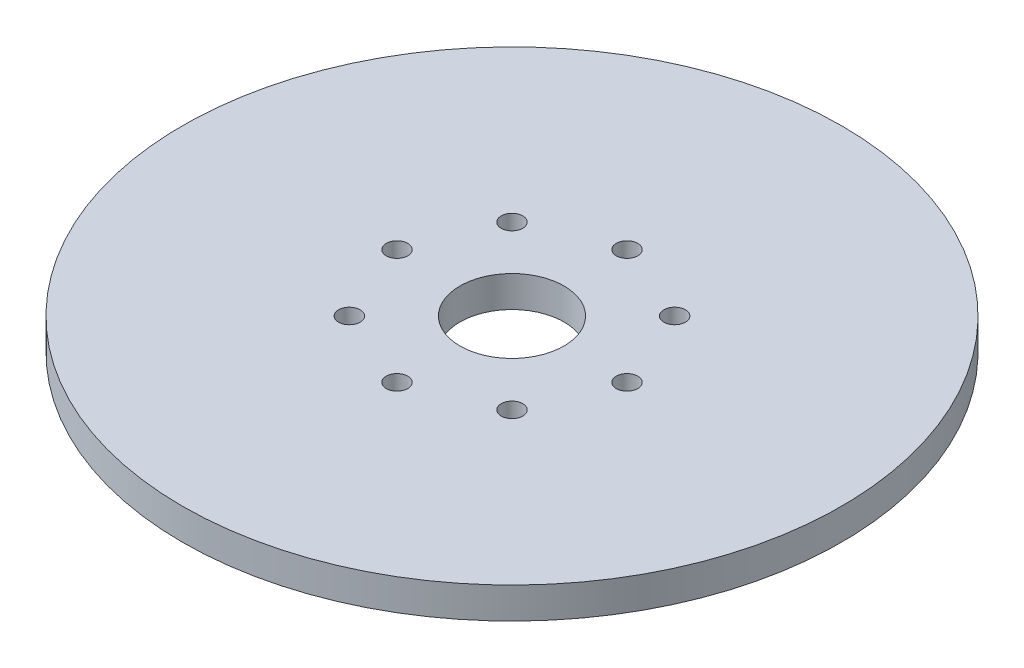
ISO-10303-21;
HEADER;
FILE_DESCRIPTION(('STEP AP214'),'2;1');
FILE_NAME('part.step','',(''),(''),'','','');
FILE_SCHEMA(('AUTOMOTIVE_DESIGN { 1 0 10303 214 1 1 1 1 }'));
ENDSEC;
DATA;
#1=APPLICATION_CONTEXT('core data for automotive mechanical design processes');
#2=APPLICATION_PROTOCOL_DEFINITION('international standard','automotive_design',2000,#1);
#3=PRODUCT_CONTEXT('',#1,'mechanical');
#4=PRODUCT('Part','Part','',(#3));
#5=PRODUCT_RELATED_PRODUCT_CATEGORY('part','',(#4));
#6=PRODUCT_DEFINITION_FORMATION('','',#4);
#7=PRODUCT_DEFINITION_CONTEXT('part definition',#1,'design');
#8=PRODUCT_DEFINITION('design','',#6,#7);
#9=PRODUCT_DEFINITION_SHAPE('','',#8);
#10=(LENGTH_UNIT() NAMED_UNIT(*) SI_UNIT(.MILLI.,.METRE.));
#11=(NAMED_UNIT(*) PLANE_ANGLE_UNIT() SI_UNIT($,.RADIAN.));
#12=(NAMED_UNIT(*) SI_UNIT($,.STERADIAN.) SOLID_ANGLE_UNIT());
#13=UNCERTAINTY_MEASURE_WITH_UNIT(LENGTH_MEASURE(1.E-05),#10,'distance_accuracy_value','');
#14=(GEOMETRIC_REPRESENTATION_CONTEXT(3) GLOBAL_UNCERTAINTY_ASSIGNED_CONTEXT((#13)) GLOBAL_UNIT_ASSIGNED_CONTEXT((#10,
#11,#12)) REPRESENTATION_CONTEXT('',''));
#15=CARTESIAN_POINT('',(0.,0.,0.));
#16=DIRECTION('',(0.,0.,1.));
#17=DIRECTION('',(1.,0.,0.));
#18=AXIS2_PLACEMENT_3D('',#15,#16,#17);
#19=CARTESIAN_POINT('',(0.,9.,0.));
#20=DIRECTION('',(0.,-1.,0.));
#21=DIRECTION('',(0.,0.,-1.));
#22=AXIS2_PLACEMENT_3D('',#19,#20,#21);
#23=CYLINDRICAL_SURFACE('',#22,95.);
#24=CARTESIAN_POINT('',(0.,9.,0.));
#25=DIRECTION('',(0.,1.,0.));
#26=DIRECTION('',(0.,0.,1.));
#27=AXIS2_PLACEMENT_3D('',#24,#25,#26);
#28=CIRCLE('',#27,95.);
#29=CARTESIAN_POINT('',(0.,9.,95.));
#30=VERTEX_POINT('',#29);
#31=EDGE_CURVE('E10',#30,#30,#28,.T.);
#32=ORIENTED_EDGE('',*,*,#31,.F.);
#33=EDGE_LOOP('',(#32));
#34=FACE_BOUND('',#33,.T.);
#35=CARTESIAN_POINT('',(0.,0.,0.));
#36=DIRECTION('',(0.,1.,0.));
#37=DIRECTION('',(0.,0.,1.));
#38=AXIS2_PLACEMENT_3D('',#35,#36,#37);
#39=CIRCLE('',#38,95.);
#40=CARTESIAN_POINT('',(0.,0.,95.));
#41=VERTEX_POINT('',#40);
#42=EDGE_CURVE('E37',#41,#41,#39,.T.);
#43=ORIENTED_EDGE('',*,*,#42,.T.);
#44=EDGE_LOOP('',(#43));
#45=FACE_BOUND('',#44,.T.);
#46=ADVANCED_FACE('F40',(#34,#45),#23,.T.);
#47=CARTESIAN_POINT('',(0.,9.,0.));
#48=DIRECTION('',(0.,1.,0.));
#49=DIRECTION('',(0.,0.,1.));
#50=AXIS2_PLACEMENT_3D('',#47,#48,#49);
#51=PLANE('',#50);
#52=CARTESIAN_POINT('',(1.15748573360503E-13,9.,33.151709010381));
#53=DIRECTION('',(0.,1.,0.));
#54=DIRECTION('',(1.,0.,0.));
#55=AXIS2_PLACEMENT_3D('',#52,#53,#54);
#56=CIRCLE('',#55,3.10765287868737);
#57=CARTESIAN_POINT('',(3.10765287868749,9.,33.151709010381));
#58=VERTEX_POINT('',#57);
#59=EDGE_CURVE('E88',#58,#58,#56,.T.);
#60=ORIENTED_EDGE('',*,*,#59,.F.);
#61=EDGE_LOOP('',(#60));
#62=FACE_BOUND('',#61,.T.);
#63=CARTESIAN_POINT('',(23.4417982491637,9.,23.4417982491634));
#64=DIRECTION('',(0.,1.,0.));
#65=DIRECTION('',(0.707106781186544,0.,-0.707106781186551));
#66=AXIS2_PLACEMENT_3D('',#63,#64,#65);
#67=CIRCLE('',#66,3.10765287868737);
#68=CARTESIAN_POINT('',(25.6392406732574,9.,21.2443558250697));
#69=VERTEX_POINT('',#68);
#70=EDGE_CURVE('E79',#69,#69,#67,.T.);
#71=ORIENTED_EDGE('',*,*,#70,.F.);
#72=EDGE_LOOP('',(#71));
#73=FACE_BOUND('',#72,.T.);
#74=CARTESIAN_POINT('',(33.151709010381,9.,0.));
#75=DIRECTION('',(0.,1.,0.));
#76=DIRECTION('',(0.,0.,-1.));
#77=AXIS2_PLACEMENT_3D('',#74,#75,#76);
#78=CIRCLE('',#77,3.10765287868737);
#79=CARTESIAN_POINT('',(33.151709010381,9.,-3.10765287868737));
#80=VERTEX_POINT('',#79);
#81=EDGE_CURVE('E74',#80,#80,#78,.T.);
#82=ORIENTED_EDGE('',*,*,#81,.F.);
#83=EDGE_LOOP('',(#82));
#84=FACE_BOUND('',#83,.T.);
#85=CARTESIAN_POINT('',(23.4417982491634,9.,-23.4417982491638));
#86=DIRECTION('',(0.,1.,0.));
#87=DIRECTION('',(-0.707106781186554,0.,-0.707106781186541));
#88=AXIS2_PLACEMENT_3D('',#85,#86,#87);
#89=CIRCLE('',#88,3.10765287868737);
#90=CARTESIAN_POINT('',(21.2443558250696,9.,-25.6392406732575));
#91=VERTEX_POINT('',#90);
#92=EDGE_CURVE('E70',#91,#91,#89,.T.);
#93=ORIENTED_EDGE('',*,*,#92,.F.);
#94=EDGE_LOOP('',(#93));
#95=FACE_BOUND('',#94,.T.);
#96=CARTESIAN_POINT('',(-3.47245720081509E-13,9.,-33.151709010381));
#97=DIRECTION('',(0.,1.,0.));
#98=DIRECTION('',(-1.,0.,0.));
#99=AXIS2_PLACEMENT_3D('',#96,#97,#98);
#100=CIRCLE('',#99,3.10765287868737);
#101=CARTESIAN_POINT('',(-3.10765287868772,9.,-33.1517090103809));
#102=VERTEX_POINT('',#101);
#103=EDGE_CURVE('E100',#102,#102,#100,.T.);
#104=ORIENTED_EDGE('',*,*,#103,.F.);
#105=EDGE_LOOP('',(#104));
#106=FACE_BOUND('',#105,.T.);
#107=CARTESIAN_POINT('',(-23.4417982491638,9.,-23.4417982491633));
#108=DIRECTION('',(0.,1.,0.));
#109=DIRECTION('',(-0.707106781186539,0.,0.707106781186556));
#110=AXIS2_PLACEMENT_3D('',#107,#108,#109);
#111=CIRCLE('',#110,3.10765287868737);
#112=CARTESIAN_POINT('',(-25.6392406732576,9.,-21.2443558250695));
#113=VERTEX_POINT('',#112);
#114=EDGE_CURVE('E93',#113,#113,#111,.T.);
#115=ORIENTED_EDGE('',*,*,#114,.F.);
#116=EDGE_LOOP('',(#115));
#117=FACE_BOUND('',#116,.T.);
#118=CARTESIAN_POINT('',(-23.4417982491635,9.,23.4417982491636));
#119=DIRECTION('',(0.,1.,0.));
#120=DIRECTION('',(0.707106781186549,0.,0.707106781186546));
#121=AXIS2_PLACEMENT_3D('',#118,#119,#120);
#122=CIRCLE('',#121,3.10765287868737);
#123=CARTESIAN_POINT('',(-21.2443558250698,9.,25.6392406732573));
#124=VERTEX_POINT('',#123);
#125=EDGE_CURVE('E61',#124,#124,#122,.T.);
#126=ORIENTED_EDGE('',*,*,#125,.F.);
#127=EDGE_LOOP('',(#126));
#128=FACE_BOUND('',#127,.T.);
#129=CARTESIAN_POINT('',(-33.151709010381,9.,0.));
#130=DIRECTION('',(0.,1.,0.));
#131=DIRECTION('',(0.,0.,1.));
#132=AXIS2_PLACEMENT_3D('',#129,#130,#131);
#133=CIRCLE('',#132,3.10765287868737);
#134=CARTESIAN_POINT('',(-33.151709010381,9.,3.10765287868737));
#135=VERTEX_POINT('',#134);
#136=EDGE_CURVE('E54',#135,#135,#133,.T.);
#137=ORIENTED_EDGE('',*,*,#136,.F.);
#138=EDGE_LOOP('',(#137));
#139=FACE_BOUND('',#138,.T.);
#140=CARTESIAN_POINT('',(0.,9.,0.));
#141=DIRECTION('',(0.,1.,0.));
#142=DIRECTION('',(0.,0.,1.));
#143=AXIS2_PLACEMENT_3D('',#140,#141,#142);
#144=CIRCLE('',#143,15.);
#145=CARTESIAN_POINT('',(0.,9.,15.));
#146=VERTEX_POINT('',#145);
#147=EDGE_CURVE('E50',#146,#146,#144,.T.);
#148=ORIENTED_EDGE('',*,*,#147,.F.);
#149=EDGE_LOOP('',(#148));
#150=FACE_BOUND('',#149,.T.);
#151=ORIENTED_EDGE('',*,*,#31,.T.);
#152=EDGE_LOOP('',(#151));
#153=FACE_BOUND('',#152,.T.);
#154=ADVANCED_FACE('F115',(#62,#73,#84,#95,#106,#117,#128,#139,#150,#153),#51,.T.);
#155=CARTESIAN_POINT('',(0.,0.,0.));
#156=DIRECTION('',(0.,1.,0.));
#157=DIRECTION('',(0.,0.,1.));
#158=AXIS2_PLACEMENT_3D('',#155,#156,#157);
#159=PLANE('',#158);
#160=CARTESIAN_POINT('',(0.,0.,0.));
#161=DIRECTION('',(0.,1.,0.));
#162=DIRECTION('',(0.,0.,1.));
#163=AXIS2_PLACEMENT_3D('',#160,#161,#162);
#164=CIRCLE('',#163,15.);
#165=CARTESIAN_POINT('',(0.,0.,15.));
#166=VERTEX_POINT('',#165);
#167=EDGE_CURVE('E47',#166,#166,#164,.T.);
#168=ORIENTED_EDGE('',*,*,#167,.T.);
#169=EDGE_LOOP('',(#168));
#170=FACE_BOUND('',#169,.T.);
#171=ORIENTED_EDGE('',*,*,#42,.F.);
#172=EDGE_LOOP('',(#171));
#173=FACE_BOUND('',#172,.T.);
#174=ADVANCED_FACE('F113',(#170,#173),#159,.F.);
#175=CARTESIAN_POINT('',(0.,9.,0.));
#176=DIRECTION('',(0.,-1.,0.));
#177=DIRECTION('',(0.,0.,-1.));
#178=AXIS2_PLACEMENT_3D('',#175,#176,#177);
#179=CYLINDRICAL_SURFACE('',#178,15.);
#180=ORIENTED_EDGE('',*,*,#147,.T.);
#181=EDGE_LOOP('',(#180));
#182=FACE_BOUND('',#181,.T.);
#183=ORIENTED_EDGE('',*,*,#167,.F.);
#184=EDGE_LOOP('',(#183));
#185=FACE_BOUND('',#184,.T.);
#186=ADVANCED_FACE('F127',(#182,#185),#179,.F.);
#187=CARTESIAN_POINT('',(-33.151709010381,1.9545763254695,0.));
#188=DIRECTION('',(0.,1.,0.));
#189=DIRECTION('',(0.,0.,1.));
#190=AXIS2_PLACEMENT_3D('',#187,#188,#189);
#191=CYLINDRICAL_SURFACE('',#190,3.10765287868737);
#192=CARTESIAN_POINT('',(-33.151709010381,1.9545763254695,0.));
#193=DIRECTION('',(0.,1.,0.));
#194=DIRECTION('',(0.,0.,1.));
#195=AXIS2_PLACEMENT_3D('',#192,#193,#194);
#196=CIRCLE('',#195,3.10765287868737);
#197=CARTESIAN_POINT('',(-33.151709010381,1.9545763254695,3.10765287868737));
#198=VERTEX_POINT('',#197);
#199=EDGE_CURVE('E55',#198,#198,#196,.T.);
#200=ORIENTED_EDGE('',*,*,#199,.F.);
#201=EDGE_LOOP('',(#200));
#202=FACE_BOUND('',#201,.T.);
#203=ORIENTED_EDGE('',*,*,#136,.T.);
#204=EDGE_LOOP('',(#203));
#205=FACE_BOUND('',#204,.T.);
#206=ADVANCED_FACE('F129',(#202,#205),#191,.F.);
#207=CARTESIAN_POINT('',(-33.151709010381,1.9545763254695,0.));
#208=DIRECTION('',(0.,1.,0.));
#209=DIRECTION('',(0.,0.,1.));
#210=AXIS2_PLACEMENT_3D('',#207,#208,#209);
#211=PLANE('',#210);
#212=ORIENTED_EDGE('',*,*,#199,.T.);
#213=EDGE_LOOP('',(#212));
#214=FACE_BOUND('',#213,.T.);
#215=ADVANCED_FACE('F157',(#214),#211,.T.);
#216=CARTESIAN_POINT('',(-23.4417982491635,1.9545763254695,23.4417982491636));
#217=DIRECTION('',(0.,1.,0.));
#218=DIRECTION('',(0.,0.,1.));
#219=AXIS2_PLACEMENT_3D('',#216,#217,#218);
#220=CYLINDRICAL_SURFACE('',#219,3.10765287868737);
#221=CARTESIAN_POINT('',(-23.4417982491635,1.9545763254695,23.4417982491636));
#222=DIRECTION('',(0.,1.,0.));
#223=DIRECTION('',(0.707106781186549,0.,0.707106781186546));
#224=AXIS2_PLACEMENT_3D('',#221,#222,#223);
#225=CIRCLE('',#224,3.10765287868737);
#226=CARTESIAN_POINT('',(-21.2443558250698,1.9545763254695,25.6392406732573));
#227=VERTEX_POINT('',#226);
#228=EDGE_CURVE('E59',#227,#227,#225,.T.);
#229=ORIENTED_EDGE('',*,*,#228,.F.);
#230=EDGE_LOOP('',(#229));
#231=FACE_BOUND('',#230,.T.);
#232=ORIENTED_EDGE('',*,*,#125,.T.);
#233=EDGE_LOOP('',(#232));
#234=FACE_BOUND('',#233,.T.);
#235=ADVANCED_FACE('F170',(#231,#234),#220,.F.);
#236=CARTESIAN_POINT('',(-23.4417982491635,1.9545763254695,23.4417982491636));
#237=DIRECTION('',(0.,1.,0.));
#238=DIRECTION('',(0.707106781186549,0.,0.707106781186546));
#239=AXIS2_PLACEMENT_3D('',#236,#237,#238);
#240=PLANE('',#239);
#241=ORIENTED_EDGE('',*,*,#228,.T.);
#242=EDGE_LOOP('',(#241));
#243=FACE_BOUND('',#242,.T.);
#244=ADVANCED_FACE('F182',(#243),#240,.T.);
#245=CARTESIAN_POINT('',(-23.4417982491638,1.9545763254695,-23.4417982491633));
#246=DIRECTION('',(0.,1.,0.));
#247=DIRECTION('',(0.,0.,1.));
#248=AXIS2_PLACEMENT_3D('',#245,#246,#247);
#249=CYLINDRICAL_SURFACE('',#248,3.10765287868737);
#250=CARTESIAN_POINT('',(-23.4417982491638,1.9545763254695,-23.4417982491633));
#251=DIRECTION('',(0.,1.,0.));
#252=DIRECTION('',(-0.707106781186539,0.,0.707106781186556));
#253=AXIS2_PLACEMENT_3D('',#250,#251,#252);
#254=CIRCLE('',#253,3.10765287868737);
#255=CARTESIAN_POINT('',(-25.6392406732576,1.9545763254695,-21.2443558250695));
#256=VERTEX_POINT('',#255);
#257=EDGE_CURVE('E94',#256,#256,#254,.T.);
#258=ORIENTED_EDGE('',*,*,#257,.F.);
#259=EDGE_LOOP('',(#258));
#260=FACE_BOUND('',#259,.T.);
#261=ORIENTED_EDGE('',*,*,#114,.T.);
#262=EDGE_LOOP('',(#261));
#263=FACE_BOUND('',#262,.T.);
#264=ADVANCED_FACE('F189',(#260,#263),#249,.F.);
#265=CARTESIAN_POINT('',(-23.4417982491638,1.9545763254695,-23.4417982491633));
#266=DIRECTION('',(0.,1.,0.));
#267=DIRECTION('',(-0.707106781186539,0.,0.707106781186556));
#268=AXIS2_PLACEMENT_3D('',#265,#266,#267);
#269=PLANE('',#268);
#270=ORIENTED_EDGE('',*,*,#257,.T.);
#271=EDGE_LOOP('',(#270));
#272=FACE_BOUND('',#271,.T.);
#273=ADVANCED_FACE('F107',(#272),#269,.T.);
#274=CARTESIAN_POINT('',(-3.47245720081509E-13,1.9545763254695,-33.151709010381));
#275=DIRECTION('',(0.,1.,0.));
#276=DIRECTION('',(0.,0.,1.));
#277=AXIS2_PLACEMENT_3D('',#274,#275,#276);
#278=CYLINDRICAL_SURFACE('',#277,3.10765287868737);
#279=CARTESIAN_POINT('',(-3.47245720081509E-13,1.9545763254695,-33.151709010381));
#280=DIRECTION('',(0.,1.,0.));
#281=DIRECTION('',(-1.,0.,0.));
#282=AXIS2_PLACEMENT_3D('',#279,#280,#281);
#283=CIRCLE('',#282,3.10765287868737);
#284=CARTESIAN_POINT('',(-3.10765287868772,1.9545763254695,-33.1517090103809));
#285=VERTEX_POINT('',#284);
#286=EDGE_CURVE('E72',#285,#285,#283,.T.);
#287=ORIENTED_EDGE('',*,*,#286,.F.);
#288=EDGE_LOOP('',(#287));
#289=FACE_BOUND('',#288,.T.);
#290=ORIENTED_EDGE('',*,*,#103,.T.);
#291=EDGE_LOOP('',(#290));
#292=FACE_BOUND('',#291,.T.);
#293=ADVANCED_FACE('F104',(#289,#292),#278,.F.);
#294=CARTESIAN_POINT('',(-3.47245720081509E-13,1.9545763254695,-33.151709010381));
#295=DIRECTION('',(0.,1.,0.));
#296=DIRECTION('',(-1.,0.,0.));
#297=AXIS2_PLACEMENT_3D('',#294,#295,#296);
#298=PLANE('',#297);
#299=ORIENTED_EDGE('',*,*,#286,.T.);
#300=EDGE_LOOP('',(#299));
#301=FACE_BOUND('',#300,.T.);
#302=ADVANCED_FACE('F103',(#301),#298,.T.);
#303=CARTESIAN_POINT('',(23.4417982491634,1.9545763254695,-23.4417982491638));
#304=DIRECTION('',(0.,1.,0.));
#305=DIRECTION('',(0.,0.,1.));
#306=AXIS2_PLACEMENT_3D('',#303,#304,#305);
#307=CYLINDRICAL_SURFACE('',#306,3.10765287868737);
#308=CARTESIAN_POINT('',(23.4417982491634,1.9545763254695,-23.4417982491638));
#309=DIRECTION('',(0.,1.,0.));
#310=DIRECTION('',(-0.707106781186554,0.,-0.707106781186541));
#311=AXIS2_PLACEMENT_3D('',#308,#309,#310);
#312=CIRCLE('',#311,3.10765287868737);
#313=CARTESIAN_POINT('',(21.2443558250696,1.9545763254695,-25.6392406732575));
#314=VERTEX_POINT('',#313);
#315=EDGE_CURVE('E69',#314,#314,#312,.T.);
#316=ORIENTED_EDGE('',*,*,#315,.F.);
#317=EDGE_LOOP('',(#316));
#318=FACE_BOUND('',#317,.T.);
#319=ORIENTED_EDGE('',*,*,#92,.T.);
#320=EDGE_LOOP('',(#319));
#321=FACE_BOUND('',#320,.T.);
#322=ADVANCED_FACE('F219',(#318,#321),#307,.F.);
#323=CARTESIAN_POINT('',(23.4417982491634,1.9545763254695,-23.4417982491638));
#324=DIRECTION('',(0.,1.,0.));
#325=DIRECTION('',(-0.707106781186554,0.,-0.707106781186541));
#326=AXIS2_PLACEMENT_3D('',#323,#324,#325);
#327=PLANE('',#326);
#328=ORIENTED_EDGE('',*,*,#315,.T.);
#329=EDGE_LOOP('',(#328));
#330=FACE_BOUND('',#329,.T.);
#331=ADVANCED_FACE('F227',(#330),#327,.T.);
#332=CARTESIAN_POINT('',(33.151709010381,1.9545763254695,0.));
#333=DIRECTION('',(0.,1.,0.));
#334=DIRECTION('',(0.,0.,1.));
#335=AXIS2_PLACEMENT_3D('',#332,#333,#334);
#336=CYLINDRICAL_SURFACE('',#335,3.10765287868737);
#337=CARTESIAN_POINT('',(33.151709010381,1.9545763254695,0.));
#338=DIRECTION('',(0.,1.,0.));
#339=DIRECTION('',(0.,0.,-1.));
#340=AXIS2_PLACEMENT_3D('',#337,#338,#339);
#341=CIRCLE('',#340,3.10765287868737);
#342=CARTESIAN_POINT('',(33.151709010381,1.9545763254695,-3.10765287868737));
#343=VERTEX_POINT('',#342);
#344=EDGE_CURVE('E80',#343,#343,#341,.T.);
#345=ORIENTED_EDGE('',*,*,#344,.F.);
#346=EDGE_LOOP('',(#345));
#347=FACE_BOUND('',#346,.T.);
#348=ORIENTED_EDGE('',*,*,#81,.T.);
#349=EDGE_LOOP('',(#348));
#350=FACE_BOUND('',#349,.T.);
#351=ADVANCED_FACE('F240',(#347,#350),#336,.F.);
#352=CARTESIAN_POINT('',(33.151709010381,1.9545763254695,0.));
#353=DIRECTION('',(0.,1.,0.));
#354=DIRECTION('',(0.,0.,-1.));
#355=AXIS2_PLACEMENT_3D('',#352,#353,#354);
#356=PLANE('',#355);
#357=ORIENTED_EDGE('',*,*,#344,.T.);
#358=EDGE_LOOP('',(#357));
#359=FACE_BOUND('',#358,.T.);
#360=ADVANCED_FACE('F246',(#359),#356,.T.);
#361=CARTESIAN_POINT('',(23.4417982491637,1.9545763254695,23.4417982491634));
#362=DIRECTION('',(0.,1.,0.));
#363=DIRECTION('',(0.,0.,1.));
#364=AXIS2_PLACEMENT_3D('',#361,#362,#363);
#365=CYLINDRICAL_SURFACE('',#364,3.10765287868737);
#366=CARTESIAN_POINT('',(23.4417982491637,1.9545763254695,23.4417982491634));
#367=DIRECTION('',(0.,1.,0.));
#368=DIRECTION('',(0.707106781186544,0.,-0.707106781186551));
#369=AXIS2_PLACEMENT_3D('',#366,#367,#368);
#370=CIRCLE('',#369,3.10765287868737);
#371=CARTESIAN_POINT('',(25.6392406732574,1.9545763254695,21.2443558250697));
#372=VERTEX_POINT('',#371);
#373=EDGE_CURVE('E82',#372,#372,#370,.T.);
#374=ORIENTED_EDGE('',*,*,#373,.F.);
#375=EDGE_LOOP('',(#374));
#376=FACE_BOUND('',#375,.T.);
#377=ORIENTED_EDGE('',*,*,#70,.T.);
#378=EDGE_LOOP('',(#377));
#379=FACE_BOUND('',#378,.T.);
#380=ADVANCED_FACE('F254',(#376,#379),#365,.F.);
#381=CARTESIAN_POINT('',(23.4417982491637,1.9545763254695,23.4417982491634));
#382=DIRECTION('',(0.,1.,0.));
#383=DIRECTION('',(0.707106781186544,0.,-0.707106781186551));
#384=AXIS2_PLACEMENT_3D('',#381,#382,#383);
#385=PLANE('',#384);
#386=ORIENTED_EDGE('',*,*,#373,.T.);
#387=EDGE_LOOP('',(#386));
#388=FACE_BOUND('',#387,.T.);
#389=ADVANCED_FACE('F262',(#388),#385,.T.);
#390=CARTESIAN_POINT('',(1.15748573360503E-13,1.9545763254695,33.151709010381));
#391=DIRECTION('',(0.,1.,0.));
#392=DIRECTION('',(0.,0.,1.));
#393=AXIS2_PLACEMENT_3D('',#390,#391,#392);
#394=CYLINDRICAL_SURFACE('',#393,3.10765287868737);
#395=CARTESIAN_POINT('',(1.15748573360503E-13,1.9545763254695,33.151709010381));
#396=DIRECTION('',(0.,1.,0.));
#397=DIRECTION('',(1.,0.,0.));
#398=AXIS2_PLACEMENT_3D('',#395,#396,#397);
#399=CIRCLE('',#398,3.10765287868737);
#400=CARTESIAN_POINT('',(3.10765287868749,1.9545763254695,33.151709010381));
#401=VERTEX_POINT('',#400);
#402=EDGE_CURVE('E63',#401,#401,#399,.T.);
#403=ORIENTED_EDGE('',*,*,#402,.F.);
#404=EDGE_LOOP('',(#403));
#405=FACE_BOUND('',#404,.T.);
#406=ORIENTED_EDGE('',*,*,#59,.T.);
#407=EDGE_LOOP('',(#406));
#408=FACE_BOUND('',#407,.T.);
#409=ADVANCED_FACE('F272',(#405,#408),#394,.F.);
#410=CARTESIAN_POINT('',(1.15748573360503E-13,1.9545763254695,33.151709010381));
#411=DIRECTION('',(0.,1.,0.));
#412=DIRECTION('',(1.,0.,0.));
#413=AXIS2_PLACEMENT_3D('',#410,#411,#412);
#414=PLANE('',#413);
#415=ORIENTED_EDGE('',*,*,#402,.T.);
#416=EDGE_LOOP('',(#415));
#417=FACE_BOUND('',#416,.T.);
#418=ADVANCED_FACE('F285',(#417),#414,.T.);
#419=CLOSED_SHELL('',(#46,#154,#174,#186,#206,#215,#235,#244,#264,#273,#293,#302,#322,#331,#351,
#360,#380,#389,#409,#418));
#420=MANIFOLD_SOLID_BREP('B2',#419);
#421=ADVANCED_BREP_SHAPE_REPRESENTATION('',(#18,#420),#14);
#422=SHAPE_DEFINITION_REPRESENTATION(#9,#421);
ENDSEC;
END-ISO-10303-21;
